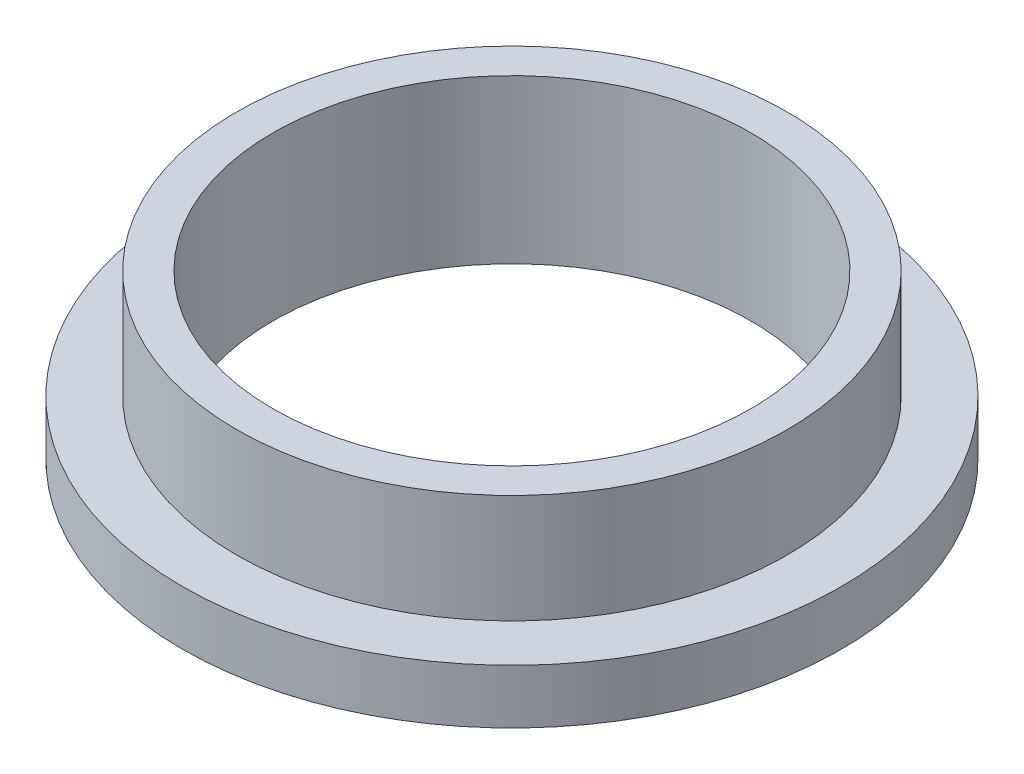
ISO-10303-21;
HEADER;
FILE_DESCRIPTION(('STEP AP214'),'2;1');
FILE_NAME('part.step','',(''),(''),'','','');
FILE_SCHEMA(('AUTOMOTIVE_DESIGN { 1 0 10303 214 1 1 1 1 }'));
ENDSEC;
DATA;
#1=APPLICATION_CONTEXT('core data for automotive mechanical design processes');
#2=APPLICATION_PROTOCOL_DEFINITION('international standard','automotive_design',2000,#1);
#3=PRODUCT_CONTEXT('',#1,'mechanical');
#4=PRODUCT('Part','Part','',(#3));
#5=PRODUCT_RELATED_PRODUCT_CATEGORY('part','',(#4));
#6=PRODUCT_DEFINITION_FORMATION('','',#4);
#7=PRODUCT_DEFINITION_CONTEXT('part definition',#1,'design');
#8=PRODUCT_DEFINITION('design','',#6,#7);
#9=PRODUCT_DEFINITION_SHAPE('','',#8);
#10=(LENGTH_UNIT() NAMED_UNIT(*) SI_UNIT(.MILLI.,.METRE.));
#11=(NAMED_UNIT(*) PLANE_ANGLE_UNIT() SI_UNIT($,.RADIAN.));
#12=(NAMED_UNIT(*) SI_UNIT($,.STERADIAN.) SOLID_ANGLE_UNIT());
#13=UNCERTAINTY_MEASURE_WITH_UNIT(LENGTH_MEASURE(1.E-05),#10,'distance_accuracy_value','');
#14=(GEOMETRIC_REPRESENTATION_CONTEXT(3) GLOBAL_UNCERTAINTY_ASSIGNED_CONTEXT((#13)) GLOBAL_UNIT_ASSIGNED_CONTEXT((#10,
#11,#12)) REPRESENTATION_CONTEXT('',''));
#15=CARTESIAN_POINT('',(0.,0.,0.));
#16=DIRECTION('',(0.,0.,1.));
#17=DIRECTION('',(1.,0.,0.));
#18=AXIS2_PLACEMENT_3D('',#15,#16,#17);
#19=CARTESIAN_POINT('',(0.,1.5,0.));
#20=DIRECTION('',(0.,1.,0.));
#21=DIRECTION('',(0.,0.,1.));
#22=AXIS2_PLACEMENT_3D('',#19,#20,#21);
#23=PLANE('',#22);
#24=CARTESIAN_POINT('',(0.,1.5,0.));
#25=DIRECTION('',(0.,1.,0.));
#26=DIRECTION('',(0.,0.,1.));
#27=AXIS2_PLACEMENT_3D('',#24,#25,#26);
#28=CIRCLE('',#27,9.1);
#29=CARTESIAN_POINT('',(0.,1.5,9.1));
#30=VERTEX_POINT('',#29);
#31=EDGE_CURVE('E10',#30,#30,#28,.T.);
#32=ORIENTED_EDGE('',*,*,#31,.T.);
#33=EDGE_LOOP('',(#32));
#34=FACE_BOUND('',#33,.T.);
#35=CARTESIAN_POINT('',(0.,1.5,0.));
#36=DIRECTION('',(0.,1.,0.));
#37=DIRECTION('',(0.,0.,1.));
#38=AXIS2_PLACEMENT_3D('',#35,#36,#37);
#39=CIRCLE('',#38,7.6);
#40=CARTESIAN_POINT('',(0.,1.5,7.6));
#41=VERTEX_POINT('',#40);
#42=EDGE_CURVE('E25',#41,#41,#39,.F.);
#43=ORIENTED_EDGE('',*,*,#42,.T.);
#44=EDGE_LOOP('',(#43));
#45=FACE_BOUND('',#44,.T.);
#46=ADVANCED_FACE('F14',(#34,#45),#23,.T.);
#47=CARTESIAN_POINT('',(0.,1.5,0.));
#48=DIRECTION('',(0.,-1.,0.));
#49=DIRECTION('',(0.,0.,-1.));
#50=AXIS2_PLACEMENT_3D('',#47,#48,#49);
#51=CYLINDRICAL_SURFACE('',#50,9.1);
#52=ORIENTED_EDGE('',*,*,#31,.F.);
#53=EDGE_LOOP('',(#52));
#54=FACE_BOUND('',#53,.T.);
#55=CARTESIAN_POINT('',(0.,0.,0.));
#56=DIRECTION('',(0.,1.,0.));
#57=DIRECTION('',(0.,0.,1.));
#58=AXIS2_PLACEMENT_3D('',#55,#56,#57);
#59=CIRCLE('',#58,9.1);
#60=CARTESIAN_POINT('',(0.,0.,9.1));
#61=VERTEX_POINT('',#60);
#62=EDGE_CURVE('E18',#61,#61,#59,.T.);
#63=ORIENTED_EDGE('',*,*,#62,.T.);
#64=EDGE_LOOP('',(#63));
#65=FACE_BOUND('',#64,.T.);
#66=ADVANCED_FACE('F16',(#54,#65),#51,.T.);
#67=CARTESIAN_POINT('',(0.,0.,0.));
#68=DIRECTION('',(0.,1.,0.));
#69=DIRECTION('',(0.,0.,1.));
#70=AXIS2_PLACEMENT_3D('',#67,#68,#69);
#71=PLANE('',#70);
#72=CARTESIAN_POINT('',(0.,0.,0.));
#73=DIRECTION('',(0.,1.,0.));
#74=DIRECTION('',(0.,0.,1.));
#75=AXIS2_PLACEMENT_3D('',#72,#73,#74);
#76=CIRCLE('',#75,6.6);
#77=CARTESIAN_POINT('',(0.,0.,6.6));
#78=VERTEX_POINT('',#77);
#79=EDGE_CURVE('E32',#78,#78,#76,.T.);
#80=ORIENTED_EDGE('',*,*,#79,.T.);
#81=EDGE_LOOP('',(#80));
#82=FACE_BOUND('',#81,.T.);
#83=ORIENTED_EDGE('',*,*,#62,.F.);
#84=EDGE_LOOP('',(#83));
#85=FACE_BOUND('',#84,.T.);
#86=ADVANCED_FACE('F39',(#82,#85),#71,.F.);
#87=CARTESIAN_POINT('',(0.,4.5,0.));
#88=DIRECTION('',(0.,-1.,0.));
#89=DIRECTION('',(0.,0.,-1.));
#90=AXIS2_PLACEMENT_3D('',#87,#88,#89);
#91=CYLINDRICAL_SURFACE('',#90,7.6);
#92=ORIENTED_EDGE('',*,*,#42,.F.);
#93=EDGE_LOOP('',(#92));
#94=FACE_BOUND('',#93,.T.);
#95=CARTESIAN_POINT('',(0.,4.5,0.));
#96=DIRECTION('',(0.,1.,0.));
#97=DIRECTION('',(0.,0.,1.));
#98=AXIS2_PLACEMENT_3D('',#95,#96,#97);
#99=CIRCLE('',#98,7.6);
#100=CARTESIAN_POINT('',(0.,4.5,7.6));
#101=VERTEX_POINT('',#100);
#102=EDGE_CURVE('E29',#101,#101,#99,.T.);
#103=ORIENTED_EDGE('',*,*,#102,.F.);
#104=EDGE_LOOP('',(#103));
#105=FACE_BOUND('',#104,.T.);
#106=ADVANCED_FACE('F51',(#94,#105),#91,.T.);
#107=CARTESIAN_POINT('',(0.,4.5,0.));
#108=DIRECTION('',(0.,1.,0.));
#109=DIRECTION('',(0.,0.,1.));
#110=AXIS2_PLACEMENT_3D('',#107,#108,#109);
#111=PLANE('',#110);
#112=CARTESIAN_POINT('',(0.,4.5,0.));
#113=DIRECTION('',(0.,1.,0.));
#114=DIRECTION('',(0.,0.,1.));
#115=AXIS2_PLACEMENT_3D('',#112,#113,#114);
#116=CIRCLE('',#115,6.6);
#117=CARTESIAN_POINT('',(0.,4.5,6.6));
#118=VERTEX_POINT('',#117);
#119=EDGE_CURVE('E33',#118,#118,#116,.T.);
#120=ORIENTED_EDGE('',*,*,#119,.F.);
#121=EDGE_LOOP('',(#120));
#122=FACE_BOUND('',#121,.T.);
#123=ORIENTED_EDGE('',*,*,#102,.T.);
#124=EDGE_LOOP('',(#123));
#125=FACE_BOUND('',#124,.T.);
#126=ADVANCED_FACE('F45',(#122,#125),#111,.T.);
#127=CARTESIAN_POINT('',(0.,0.,0.));
#128=DIRECTION('',(0.,1.,0.));
#129=DIRECTION('',(0.,0.,1.));
#130=AXIS2_PLACEMENT_3D('',#127,#128,#129);
#131=CYLINDRICAL_SURFACE('',#130,6.6);
#132=ORIENTED_EDGE('',*,*,#79,.F.);
#133=EDGE_LOOP('',(#132));
#134=FACE_BOUND('',#133,.T.);
#135=ORIENTED_EDGE('',*,*,#119,.T.);
#136=EDGE_LOOP('',(#135));
#137=FACE_BOUND('',#136,.T.);
#138=ADVANCED_FACE('F42',(#134,#137),#131,.F.);
#139=CLOSED_SHELL('',(#46,#66,#86,#106,#126,#138));
#140=MANIFOLD_SOLID_BREP('B1',#139);
#141=ADVANCED_BREP_SHAPE_REPRESENTATION('',(#18,#140),#14);
#142=SHAPE_DEFINITION_REPRESENTATION(#9,#141);
ENDSEC;
END-ISO-10303-21;
